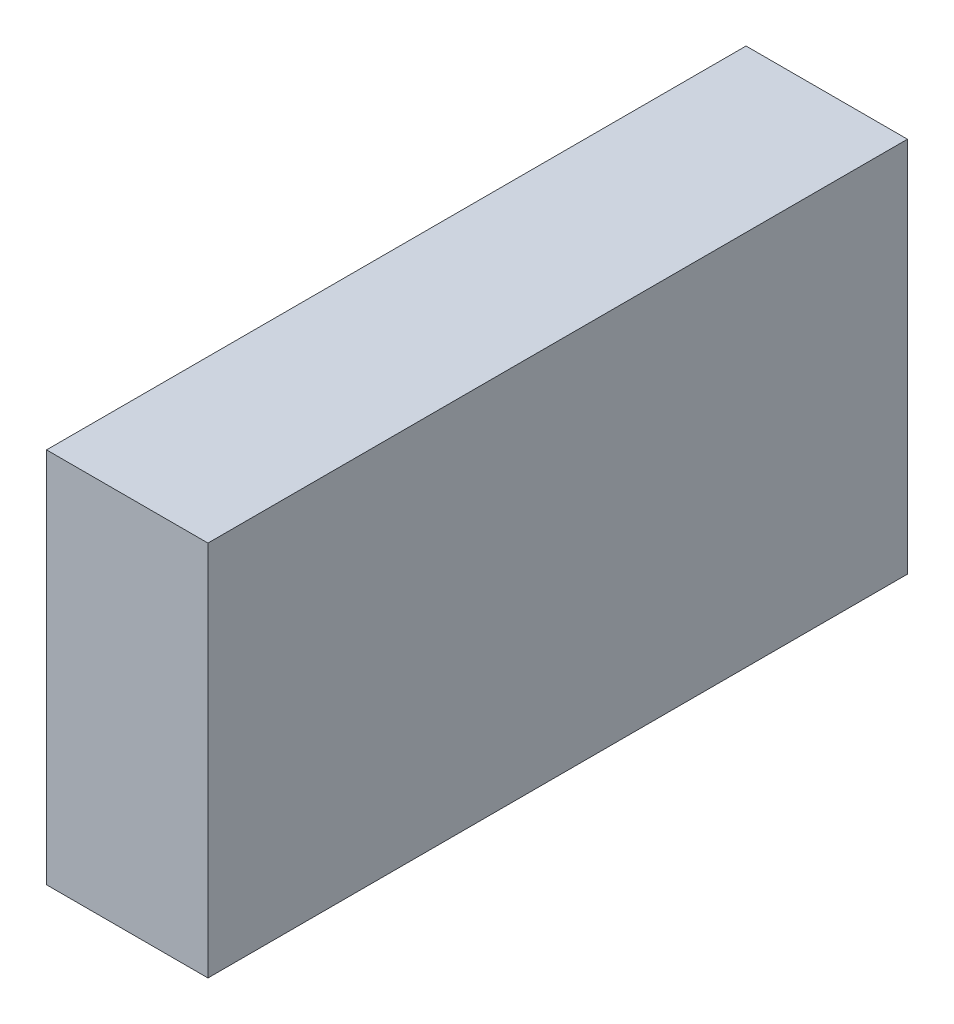
ISO-10303-21;
HEADER;
FILE_DESCRIPTION(('STEP AP214'),'2;1');
FILE_NAME('part.step','',(''),(''),'','','');
FILE_SCHEMA(('AUTOMOTIVE_DESIGN { 1 0 10303 214 1 1 1 1 }'));
ENDSEC;
DATA;
#1=APPLICATION_CONTEXT('core data for automotive mechanical design processes');
#2=APPLICATION_PROTOCOL_DEFINITION('international standard','automotive_design',2000,#1);
#3=PRODUCT_CONTEXT('',#1,'mechanical');
#4=PRODUCT('Part','Part','',(#3));
#5=PRODUCT_RELATED_PRODUCT_CATEGORY('part','',(#4));
#6=PRODUCT_DEFINITION_FORMATION('','',#4);
#7=PRODUCT_DEFINITION_CONTEXT('part definition',#1,'design');
#8=PRODUCT_DEFINITION('design','',#6,#7);
#9=PRODUCT_DEFINITION_SHAPE('','',#8);
#10=(LENGTH_UNIT() NAMED_UNIT(*) SI_UNIT(.MILLI.,.METRE.));
#11=(NAMED_UNIT(*) PLANE_ANGLE_UNIT() SI_UNIT($,.RADIAN.));
#12=(NAMED_UNIT(*) SI_UNIT($,.STERADIAN.) SOLID_ANGLE_UNIT());
#13=UNCERTAINTY_MEASURE_WITH_UNIT(LENGTH_MEASURE(1.E-05),#10,'distance_accuracy_value','');
#14=(GEOMETRIC_REPRESENTATION_CONTEXT(3) GLOBAL_UNCERTAINTY_ASSIGNED_CONTEXT((#13)) GLOBAL_UNIT_ASSIGNED_CONTEXT((#10,
#11,#12)) REPRESENTATION_CONTEXT('',''));
#15=CARTESIAN_POINT('',(0.,0.,0.));
#16=DIRECTION('',(0.,0.,1.));
#17=DIRECTION('',(1.,0.,0.));
#18=AXIS2_PLACEMENT_3D('',#15,#16,#17);
#19=CARTESIAN_POINT('',(-19.05,-44.45,82.55));
#20=DIRECTION('',(1.,0.,0.));
#21=DIRECTION('',(0.,0.,-1.));
#22=AXIS2_PLACEMENT_3D('',#19,#20,#21);
#23=PLANE('',#22);
#24=DIRECTION('',(0.,-1.,0.));
#25=VECTOR('',#24,1.);
#26=CARTESIAN_POINT('',(-19.05,-44.45,-82.55));
#27=LINE('',#26,#25);
#28=CARTESIAN_POINT('',(-19.05,44.45,-82.55));
#29=VERTEX_POINT('',#28);
#30=CARTESIAN_POINT('',(-19.05,-44.45,-82.55));
#31=VERTEX_POINT('',#30);
#32=EDGE_CURVE('E96',#29,#31,#27,.T.);
#33=ORIENTED_EDGE('',*,*,#32,.T.);
#34=DIRECTION('',(0.,0.,-1.));
#35=VECTOR('',#34,1.);
#36=CARTESIAN_POINT('',(-19.05,-44.45,82.55));
#37=LINE('',#36,#35);
#38=CARTESIAN_POINT('',(-19.05,-44.45,82.55));
#39=VERTEX_POINT('',#38);
#40=EDGE_CURVE('E11',#39,#31,#37,.T.);
#41=ORIENTED_EDGE('',*,*,#40,.F.);
#42=DIRECTION('',(0.,-1.,0.));
#43=VECTOR('',#42,1.);
#44=CARTESIAN_POINT('',(-19.05,-44.45,82.55));
#45=LINE('',#44,#43);
#46=CARTESIAN_POINT('',(-19.05,44.45,82.55));
#47=VERTEX_POINT('',#46);
#48=EDGE_CURVE('E84',#47,#39,#45,.T.);
#49=ORIENTED_EDGE('',*,*,#48,.F.);
#50=DIRECTION('',(0.,0.,-1.));
#51=VECTOR('',#50,1.);
#52=CARTESIAN_POINT('',(-19.05,44.45,82.55));
#53=LINE('',#52,#51);
#54=EDGE_CURVE('E92',#47,#29,#53,.T.);
#55=ORIENTED_EDGE('',*,*,#54,.T.);
#56=EDGE_LOOP('',(#33,#41,#49,#55));
#57=FACE_BOUND('',#56,.T.);
#58=ADVANCED_FACE('F33',(#57),#23,.F.);
#59=CARTESIAN_POINT('',(19.05,-44.45,82.55));
#60=DIRECTION('',(0.,1.,0.));
#61=DIRECTION('',(-1.,0.,0.));
#62=AXIS2_PLACEMENT_3D('',#59,#60,#61);
#63=PLANE('',#62);
#64=DIRECTION('',(1.,0.,0.));
#65=VECTOR('',#64,1.);
#66=CARTESIAN_POINT('',(19.05,-44.45,-82.55));
#67=LINE('',#66,#65);
#68=CARTESIAN_POINT('',(19.05,-44.45,-82.55));
#69=VERTEX_POINT('',#68);
#70=EDGE_CURVE('E88',#31,#69,#67,.T.);
#71=ORIENTED_EDGE('',*,*,#70,.T.);
#72=DIRECTION('',(0.,0.,-1.));
#73=VECTOR('',#72,1.);
#74=CARTESIAN_POINT('',(19.05,-44.45,82.55));
#75=LINE('',#74,#73);
#76=CARTESIAN_POINT('',(19.05,-44.45,82.55));
#77=VERTEX_POINT('',#76);
#78=EDGE_CURVE('E41',#77,#69,#75,.T.);
#79=ORIENTED_EDGE('',*,*,#78,.F.);
#80=DIRECTION('',(1.,0.,0.));
#81=VECTOR('',#80,1.);
#82=CARTESIAN_POINT('',(19.05,-44.45,82.55));
#83=LINE('',#82,#81);
#84=EDGE_CURVE('E79',#39,#77,#83,.T.);
#85=ORIENTED_EDGE('',*,*,#84,.F.);
#86=ORIENTED_EDGE('',*,*,#40,.T.);
#87=EDGE_LOOP('',(#71,#79,#85,#86));
#88=FACE_BOUND('',#87,.T.);
#89=ADVANCED_FACE('F87',(#88),#63,.F.);
#90=CARTESIAN_POINT('',(19.05,-44.45,82.55));
#91=DIRECTION('',(-1.,0.,0.));
#92=DIRECTION('',(0.,0.,1.));
#93=AXIS2_PLACEMENT_3D('',#90,#91,#92);
#94=PLANE('',#93);
#95=DIRECTION('',(0.,1.,0.));
#96=VECTOR('',#95,1.);
#97=CARTESIAN_POINT('',(19.05,-44.45,-82.55));
#98=LINE('',#97,#96);
#99=CARTESIAN_POINT('',(19.05,44.45,-82.55));
#100=VERTEX_POINT('',#99);
#101=EDGE_CURVE('E66',#69,#100,#98,.T.);
#102=ORIENTED_EDGE('',*,*,#101,.T.);
#103=DIRECTION('',(0.,0.,-1.));
#104=VECTOR('',#103,1.);
#105=CARTESIAN_POINT('',(19.05,44.45,82.55));
#106=LINE('',#105,#104);
#107=CARTESIAN_POINT('',(19.05,44.45,82.55));
#108=VERTEX_POINT('',#107);
#109=EDGE_CURVE('E89',#108,#100,#106,.T.);
#110=ORIENTED_EDGE('',*,*,#109,.F.);
#111=DIRECTION('',(0.,1.,0.));
#112=VECTOR('',#111,1.);
#113=CARTESIAN_POINT('',(19.05,-44.45,82.55));
#114=LINE('',#113,#112);
#115=EDGE_CURVE('E82',#77,#108,#114,.T.);
#116=ORIENTED_EDGE('',*,*,#115,.F.);
#117=ORIENTED_EDGE('',*,*,#78,.T.);
#118=EDGE_LOOP('',(#102,#110,#116,#117));
#119=FACE_BOUND('',#118,.T.);
#120=ADVANCED_FACE('F90',(#119),#94,.F.);
#121=CARTESIAN_POINT('',(19.05,44.45,82.55));
#122=DIRECTION('',(0.,-1.,0.));
#123=DIRECTION('',(1.,0.,0.));
#124=AXIS2_PLACEMENT_3D('',#121,#122,#123);
#125=PLANE('',#124);
#126=DIRECTION('',(-1.,0.,0.));
#127=VECTOR('',#126,1.);
#128=CARTESIAN_POINT('',(19.05,44.45,-82.55));
#129=LINE('',#128,#127);
#130=EDGE_CURVE('E72',#100,#29,#129,.T.);
#131=ORIENTED_EDGE('',*,*,#130,.T.);
#132=ORIENTED_EDGE('',*,*,#54,.F.);
#133=DIRECTION('',(-1.,0.,0.));
#134=VECTOR('',#133,1.);
#135=CARTESIAN_POINT('',(19.05,44.45,82.55));
#136=LINE('',#135,#134);
#137=EDGE_CURVE('E49',#108,#47,#136,.T.);
#138=ORIENTED_EDGE('',*,*,#137,.F.);
#139=ORIENTED_EDGE('',*,*,#109,.T.);
#140=EDGE_LOOP('',(#131,#132,#138,#139));
#141=FACE_BOUND('',#140,.T.);
#142=ADVANCED_FACE('F103',(#141),#125,.F.);
#143=CARTESIAN_POINT('',(0.,0.,82.55));
#144=DIRECTION('',(0.,0.,1.));
#145=DIRECTION('',(1.,0.,0.));
#146=AXIS2_PLACEMENT_3D('',#143,#144,#145);
#147=PLANE('',#146);
#148=ORIENTED_EDGE('',*,*,#48,.T.);
#149=ORIENTED_EDGE('',*,*,#84,.T.);
#150=ORIENTED_EDGE('',*,*,#115,.T.);
#151=ORIENTED_EDGE('',*,*,#137,.T.);
#152=EDGE_LOOP('',(#148,#149,#150,#151));
#153=FACE_BOUND('',#152,.T.);
#154=ADVANCED_FACE('F80',(#153),#147,.T.);
#155=CARTESIAN_POINT('',(0.,0.,-82.55));
#156=DIRECTION('',(0.,0.,1.));
#157=DIRECTION('',(1.,0.,0.));
#158=AXIS2_PLACEMENT_3D('',#155,#156,#157);
#159=PLANE('',#158);
#160=ORIENTED_EDGE('',*,*,#32,.F.);
#161=ORIENTED_EDGE('',*,*,#130,.F.);
#162=ORIENTED_EDGE('',*,*,#101,.F.);
#163=ORIENTED_EDGE('',*,*,#70,.F.);
#164=EDGE_LOOP('',(#160,#161,#162,#163));
#165=FACE_BOUND('',#164,.T.);
#166=ADVANCED_FACE('F106',(#165),#159,.F.);
#167=CLOSED_SHELL('',(#58,#89,#120,#142,#154,#166));
#168=MANIFOLD_SOLID_BREP('B2',#167);
#169=ADVANCED_BREP_SHAPE_REPRESENTATION('',(#18,#168),#14);
#170=SHAPE_DEFINITION_REPRESENTATION(#9,#169);
ENDSEC;
END-ISO-10303-21;
